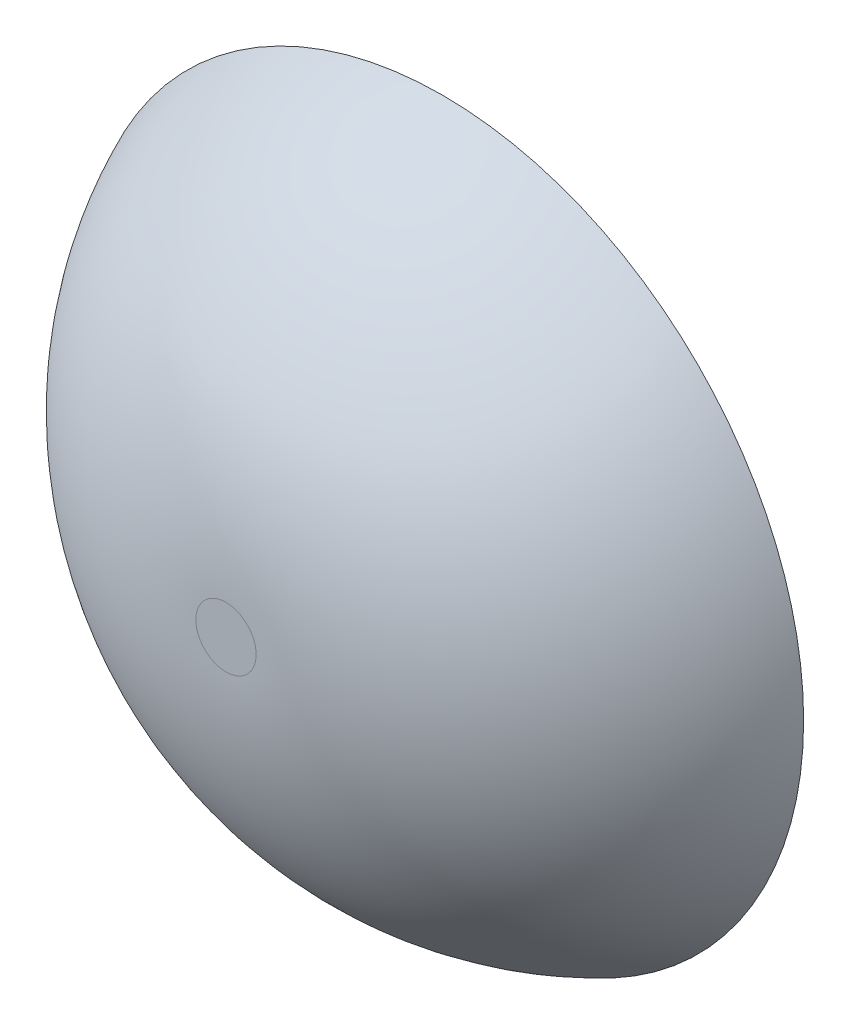
ISO-10303-21;
HEADER;
FILE_DESCRIPTION(('STEP AP214'),'2;1');
FILE_NAME('part.step','',(''),(''),'','','');
FILE_SCHEMA(('AUTOMOTIVE_DESIGN { 1 0 10303 214 1 1 1 1 }'));
ENDSEC;
DATA;
#1=APPLICATION_CONTEXT('core data for automotive mechanical design processes');
#2=APPLICATION_PROTOCOL_DEFINITION('international standard','automotive_design',2000,#1);
#3=PRODUCT_CONTEXT('',#1,'mechanical');
#4=PRODUCT('Part','Part','',(#3));
#5=PRODUCT_RELATED_PRODUCT_CATEGORY('part','',(#4));
#6=PRODUCT_DEFINITION_FORMATION('','',#4);
#7=PRODUCT_DEFINITION_CONTEXT('part definition',#1,'design');
#8=PRODUCT_DEFINITION('design','',#6,#7);
#9=PRODUCT_DEFINITION_SHAPE('','',#8);
#10=(LENGTH_UNIT() NAMED_UNIT(*) SI_UNIT(.MILLI.,.METRE.));
#11=(NAMED_UNIT(*) PLANE_ANGLE_UNIT() SI_UNIT($,.RADIAN.));
#12=(NAMED_UNIT(*) SI_UNIT($,.STERADIAN.) SOLID_ANGLE_UNIT());
#13=UNCERTAINTY_MEASURE_WITH_UNIT(LENGTH_MEASURE(1.E-05),#10,'distance_accuracy_value','');
#14=(GEOMETRIC_REPRESENTATION_CONTEXT(3) GLOBAL_UNCERTAINTY_ASSIGNED_CONTEXT((#13)) GLOBAL_UNIT_ASSIGNED_CONTEXT((#10,
#11,#12)) REPRESENTATION_CONTEXT('',''));
#15=CARTESIAN_POINT('',(0.,0.,0.));
#16=DIRECTION('',(0.,0.,1.));
#17=DIRECTION('',(1.,0.,0.));
#18=AXIS2_PLACEMENT_3D('',#15,#16,#17);
#19=CARTESIAN_POINT('',(0.,0.,3.75));
#20=DIRECTION('',(0.,0.,1.));
#21=DIRECTION('',(1.,0.,0.));
#22=AXIS2_PLACEMENT_3D('',#19,#20,#21);
#23=PLANE('',#22);
#24=CARTESIAN_POINT('',(-2.,-2.,3.75));
#25=DIRECTION('',(0.,0.,-1.));
#26=DIRECTION('',(0.,-1.,0.));
#27=AXIS2_PLACEMENT_3D('',#24,#25,#26);
#28=CIRCLE('',#27,0.0417424305044199);
#29=CARTESIAN_POINT('',(-2.,-2.04174243050442,3.75));
#30=VERTEX_POINT('',#29);
#31=CARTESIAN_POINT('',(-2.,-1.95825756949558,3.75));
#32=VERTEX_POINT('',#31);
#33=EDGE_CURVE('E36',#30,#32,#28,.T.);
#34=ORIENTED_EDGE('',*,*,#33,.F.);
#35=CARTESIAN_POINT('',(-2.,-2.,3.75));
#36=DIRECTION('',(0.,0.,-1.));
#37=DIRECTION('',(0.,1.,0.));
#38=AXIS2_PLACEMENT_3D('',#35,#36,#37);
#39=CIRCLE('',#38,0.0417424305044199);
#40=EDGE_CURVE('E27',#32,#30,#39,.T.);
#41=ORIENTED_EDGE('',*,*,#40,.F.);
#42=EDGE_LOOP('',(#34,#41));
#43=FACE_BOUND('',#42,.T.);
#44=ADVANCED_FACE('F17',(#43),#23,.T.);
#45=CARTESIAN_POINT('',(-2.,-1.95825756949558,3.25));
#46=DIRECTION('',(-1.,0.,0.));
#47=DIRECTION('',(0.,1.,0.));
#48=AXIS2_PLACEMENT_3D('',#45,#46,#47);
#49=CIRCLE('',#48,0.5);
#50=TRIMMED_CURVE('',#49,(PARAMETER_VALUE(-1.65437847094237)),
(PARAMETER_VALUE(1.65437847094237)),.T.,.PARAMETER.);
#51=CARTESIAN_POINT('',(-2.,-2.,3.25));
#52=DIRECTION('',(0.,0.,1.));
#53=AXIS1_PLACEMENT('',#51,#52);
#54=SURFACE_OF_REVOLUTION('',#50,#53);
#55=ORIENTED_EDGE('',*,*,#33,.T.);
#56=ORIENTED_EDGE('',*,*,#40,.T.);
#57=EDGE_LOOP('',(#55,#56));
#58=FACE_BOUND('',#57,.T.);
#59=CARTESIAN_POINT('',(-2.,-2.,3.45));
#60=DIRECTION('',(0.,0.,1.));
#61=DIRECTION('',(1.,0.,0.));
#62=AXIS2_PLACEMENT_3D('',#59,#60,#61);
#63=CIRCLE('',#62,0.5);
#64=CARTESIAN_POINT('',(-1.5,-2.,3.45));
#65=VERTEX_POINT('',#64);
#66=EDGE_CURVE('E11',#65,#65,#63,.T.);
#67=ORIENTED_EDGE('',*,*,#66,.T.);
#68=EDGE_LOOP('',(#67));
#69=FACE_BOUND('',#68,.T.);
#70=ADVANCED_FACE('F37',(#58,#69),#54,.F.);
#71=CARTESIAN_POINT('',(0.,0.,3.45));
#72=DIRECTION('',(0.,0.,1.));
#73=DIRECTION('',(1.,0.,0.));
#74=AXIS2_PLACEMENT_3D('',#71,#72,#73);
#75=PLANE('',#74);
#76=ORIENTED_EDGE('',*,*,#66,.F.);
#77=EDGE_LOOP('',(#76));
#78=FACE_BOUND('',#77,.T.);
#79=ADVANCED_FACE('F65',(#78),#75,.F.);
#80=CLOSED_SHELL('',(#44,#70,#79));
#81=MANIFOLD_SOLID_BREP('B1',#80);
#82=ADVANCED_BREP_SHAPE_REPRESENTATION('',(#18,#81),#14);
#83=SHAPE_DEFINITION_REPRESENTATION(#9,#82);
ENDSEC;
END-ISO-10303-21;
